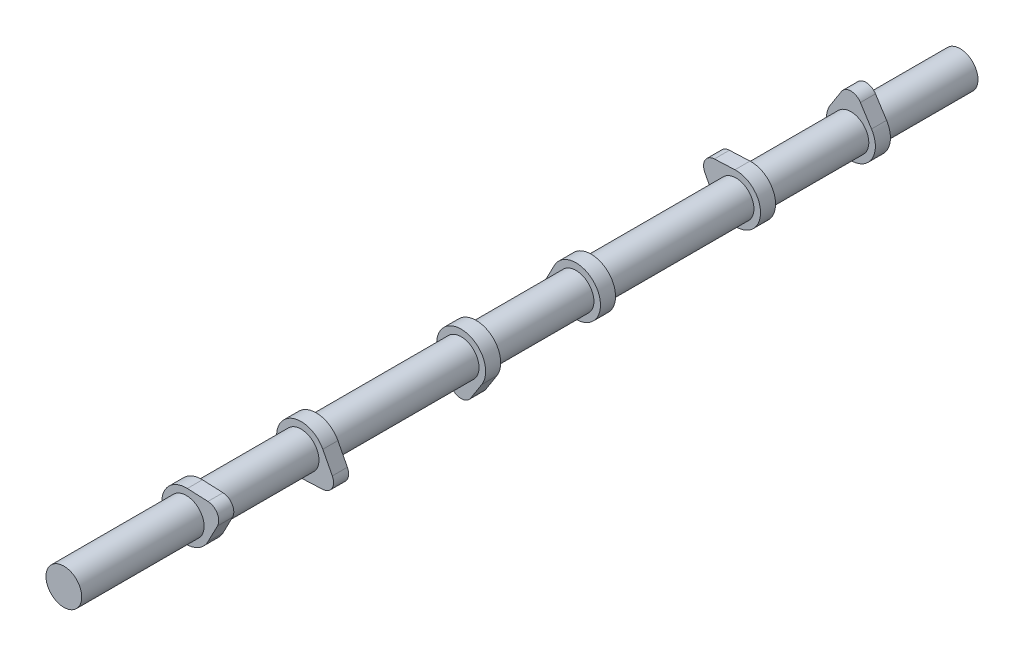
ISO-10303-21;
HEADER;
FILE_DESCRIPTION(('STEP AP214'),'2;1');
FILE_NAME('part.step','',(''),(''),'','','');
FILE_SCHEMA(('AUTOMOTIVE_DESIGN { 1 0 10303 214 1 1 1 1 }'));
ENDSEC;
DATA;
#1=APPLICATION_CONTEXT('core data for automotive mechanical design processes');
#2=APPLICATION_PROTOCOL_DEFINITION('international standard','automotive_design',2000,#1);
#3=PRODUCT_CONTEXT('',#1,'mechanical');
#4=PRODUCT('Part','Part','',(#3));
#5=PRODUCT_RELATED_PRODUCT_CATEGORY('part','',(#4));
#6=PRODUCT_DEFINITION_FORMATION('','',#4);
#7=PRODUCT_DEFINITION_CONTEXT('part definition',#1,'design');
#8=PRODUCT_DEFINITION('design','',#6,#7);
#9=PRODUCT_DEFINITION_SHAPE('','',#8);
#10=(LENGTH_UNIT() NAMED_UNIT(*) SI_UNIT(.MILLI.,.METRE.));
#11=(NAMED_UNIT(*) PLANE_ANGLE_UNIT() SI_UNIT($,.RADIAN.));
#12=(NAMED_UNIT(*) SI_UNIT($,.STERADIAN.) SOLID_ANGLE_UNIT());
#13=UNCERTAINTY_MEASURE_WITH_UNIT(LENGTH_MEASURE(1.E-05),#10,'distance_accuracy_value','');
#14=(GEOMETRIC_REPRESENTATION_CONTEXT(3) GLOBAL_UNCERTAINTY_ASSIGNED_CONTEXT((#13)) GLOBAL_UNIT_ASSIGNED_CONTEXT((#10,
#11,#12)) REPRESENTATION_CONTEXT('',''));
#15=CARTESIAN_POINT('',(0.,0.,0.));
#16=DIRECTION('',(0.,0.,1.));
#17=DIRECTION('',(1.,0.,0.));
#18=AXIS2_PLACEMENT_3D('',#15,#16,#17);
#19=CARTESIAN_POINT('',(0.,0.,476.));
#20=DIRECTION('',(0.,0.,-1.));
#21=DIRECTION('',(-1.,0.,0.));
#22=AXIS2_PLACEMENT_3D('',#19,#20,#21);
#23=CYLINDRICAL_SURFACE('',#22,9.5);
#24=CARTESIAN_POINT('',(0.,0.,350.));
#25=DIRECTION('',(0.,0.,1.));
#26=DIRECTION('',(1.,0.,0.));
#27=AXIS2_PLACEMENT_3D('',#24,#25,#26);
#28=CIRCLE('',#27,9.5);
#29=CARTESIAN_POINT('',(9.5,0.,350.));
#30=VERTEX_POINT('',#29);
#31=EDGE_CURVE('E270',#30,#30,#28,.T.);
#32=ORIENTED_EDGE('',*,*,#31,.T.);
#33=EDGE_LOOP('',(#32));
#34=FACE_BOUND('',#33,.T.);
#35=CARTESIAN_POINT('',(0.,0.,403.));
#36=DIRECTION('',(0.,0.,1.));
#37=DIRECTION('',(1.,0.,0.));
#38=AXIS2_PLACEMENT_3D('',#35,#36,#37);
#39=CIRCLE('',#38,9.5);
#40=CARTESIAN_POINT('',(9.5,0.,403.));
#41=VERTEX_POINT('',#40);
#42=EDGE_CURVE('E11',#41,#41,#39,.T.);
#43=ORIENTED_EDGE('',*,*,#42,.F.);
#44=EDGE_LOOP('',(#43));
#45=FACE_BOUND('',#44,.T.);
#46=ADVANCED_FACE('F37',(#34,#45),#23,.T.);
#47=CARTESIAN_POINT('',(0.,0.,265.));
#48=DIRECTION('',(0.,0.,1.));
#49=DIRECTION('',(1.,0.,0.));
#50=AXIS2_PLACEMENT_3D('',#47,#48,#49);
#51=CIRCLE('',#50,9.5);
#52=CARTESIAN_POINT('',(9.5,0.,265.));
#53=VERTEX_POINT('',#52);
#54=EDGE_CURVE('E301',#53,#53,#51,.T.);
#55=ORIENTED_EDGE('',*,*,#54,.T.);
#56=EDGE_LOOP('',(#55));
#57=FACE_BOUND('',#56,.T.);
#58=CARTESIAN_POINT('',(0.,0.,342.));
#59=DIRECTION('',(0.,0.,1.));
#60=DIRECTION('',(1.,0.,0.));
#61=AXIS2_PLACEMENT_3D('',#58,#59,#60);
#62=CIRCLE('',#61,9.5);
#63=CARTESIAN_POINT('',(9.5,0.,342.));
#64=VERTEX_POINT('',#63);
#65=EDGE_CURVE('E47',#64,#64,#62,.T.);
#66=ORIENTED_EDGE('',*,*,#65,.F.);
#67=EDGE_LOOP('',(#66));
#68=FACE_BOUND('',#67,.T.);
#69=ADVANCED_FACE('F455',(#57,#68),#23,.T.);
#70=CARTESIAN_POINT('',(0.,0.,204.));
#71=DIRECTION('',(0.,0.,1.));
#72=DIRECTION('',(1.,0.,0.));
#73=AXIS2_PLACEMENT_3D('',#70,#71,#72);
#74=CIRCLE('',#73,9.5);
#75=CARTESIAN_POINT('',(9.5,0.,204.));
#76=VERTEX_POINT('',#75);
#77=EDGE_CURVE('E332',#76,#76,#74,.T.);
#78=ORIENTED_EDGE('',*,*,#77,.T.);
#79=EDGE_LOOP('',(#78));
#80=FACE_BOUND('',#79,.T.);
#81=CARTESIAN_POINT('',(0.,0.,257.));
#82=DIRECTION('',(0.,0.,1.));
#83=DIRECTION('',(1.,0.,0.));
#84=AXIS2_PLACEMENT_3D('',#81,#82,#83);
#85=CIRCLE('',#84,9.5);
#86=CARTESIAN_POINT('',(9.5,0.,257.));
#87=VERTEX_POINT('',#86);
#88=EDGE_CURVE('E408',#87,#87,#85,.T.);
#89=ORIENTED_EDGE('',*,*,#88,.F.);
#90=EDGE_LOOP('',(#89));
#91=FACE_BOUND('',#90,.T.);
#92=ADVANCED_FACE('F459',(#80,#91),#23,.T.);
#93=CARTESIAN_POINT('',(0.,0.,119.));
#94=DIRECTION('',(0.,0.,1.));
#95=DIRECTION('',(1.,0.,0.));
#96=AXIS2_PLACEMENT_3D('',#93,#94,#95);
#97=CIRCLE('',#96,9.5);
#98=CARTESIAN_POINT('',(9.5,0.,119.));
#99=VERTEX_POINT('',#98);
#100=EDGE_CURVE('E363',#99,#99,#97,.T.);
#101=ORIENTED_EDGE('',*,*,#100,.T.);
#102=EDGE_LOOP('',(#101));
#103=FACE_BOUND('',#102,.T.);
#104=CARTESIAN_POINT('',(0.,0.,196.));
#105=DIRECTION('',(0.,0.,1.));
#106=DIRECTION('',(1.,0.,0.));
#107=AXIS2_PLACEMENT_3D('',#104,#105,#106);
#108=CIRCLE('',#107,9.5);
#109=CARTESIAN_POINT('',(9.5,0.,196.));
#110=VERTEX_POINT('',#109);
#111=EDGE_CURVE('E403',#110,#110,#108,.T.);
#112=ORIENTED_EDGE('',*,*,#111,.F.);
#113=EDGE_LOOP('',(#112));
#114=FACE_BOUND('',#113,.T.);
#115=ADVANCED_FACE('F489',(#103,#114),#23,.T.);
#116=CARTESIAN_POINT('',(0.,0.,58.));
#117=DIRECTION('',(0.,0.,-1.));
#118=DIRECTION('',(-1.,0.,0.));
#119=AXIS2_PLACEMENT_3D('',#116,#117,#118);
#120=CIRCLE('',#119,9.5);
#121=CARTESIAN_POINT('',(-9.5,0.,58.));
#122=VERTEX_POINT('',#121);
#123=EDGE_CURVE('E392',#122,#122,#120,.T.);
#124=ORIENTED_EDGE('',*,*,#123,.F.);
#125=EDGE_LOOP('',(#124));
#126=FACE_BOUND('',#125,.T.);
#127=CARTESIAN_POINT('',(0.,0.,111.));
#128=DIRECTION('',(0.,0.,1.));
#129=DIRECTION('',(1.,0.,0.));
#130=AXIS2_PLACEMENT_3D('',#127,#128,#129);
#131=CIRCLE('',#130,9.5);
#132=CARTESIAN_POINT('',(9.5,0.,111.));
#133=VERTEX_POINT('',#132);
#134=EDGE_CURVE('E400',#133,#133,#131,.T.);
#135=ORIENTED_EDGE('',*,*,#134,.F.);
#136=EDGE_LOOP('',(#135));
#137=FACE_BOUND('',#136,.T.);
#138=ADVANCED_FACE('F479',(#126,#137),#23,.T.);
#139=CARTESIAN_POINT('',(0.,0.,58.));
#140=DIRECTION('',(0.,0.,-1.));
#141=DIRECTION('',(-1.,0.,0.));
#142=AXIS2_PLACEMENT_3D('',#139,#140,#141);
#143=CYLINDRICAL_SURFACE('',#142,13.);
#144=CARTESIAN_POINT('',(0.,0.,50.));
#145=DIRECTION('',(0.,0.,-1.));
#146=DIRECTION('',(-1.,0.,0.));
#147=AXIS2_PLACEMENT_3D('',#144,#145,#146);
#148=CIRCLE('',#147,13.);
#149=CARTESIAN_POINT('',(10.9544511522889,6.99999999657977,50.));
#150=VERTEX_POINT('',#149);
#151=CARTESIAN_POINT('',(-10.9544511522889,6.99999999657977,50.));
#152=VERTEX_POINT('',#151);
#153=EDGE_CURVE('E373',#150,#152,#148,.T.);
#154=ORIENTED_EDGE('',*,*,#153,.F.);
#155=DIRECTION('',(0.,0.,-1.));
#156=VECTOR('',#155,1.);
#157=CARTESIAN_POINT('',(10.9544511522889,6.99999999657977,58.));
#158=LINE('',#157,#156);
#159=CARTESIAN_POINT('',(10.9544511522889,6.99999999657977,58.));
#160=VERTEX_POINT('',#159);
#161=EDGE_CURVE('E55',#160,#150,#158,.T.);
#162=ORIENTED_EDGE('',*,*,#161,.F.);
#163=CARTESIAN_POINT('',(0.,0.,58.));
#164=DIRECTION('',(0.,0.,-1.));
#165=DIRECTION('',(-1.,0.,0.));
#166=AXIS2_PLACEMENT_3D('',#163,#164,#165);
#167=CIRCLE('',#166,13.);
#168=CARTESIAN_POINT('',(-10.9544511522889,6.99999999657977,58.));
#169=VERTEX_POINT('',#168);
#170=EDGE_CURVE('E364',#160,#169,#167,.T.);
#171=ORIENTED_EDGE('',*,*,#170,.T.);
#172=DIRECTION('',(0.,0.,-1.));
#173=VECTOR('',#172,1.);
#174=CARTESIAN_POINT('',(-10.9544511522889,6.99999999657977,58.));
#175=LINE('',#174,#173);
#176=EDGE_CURVE('E84',#169,#152,#175,.T.);
#177=ORIENTED_EDGE('',*,*,#176,.T.);
#178=EDGE_LOOP('',(#154,#162,#171,#177));
#179=FACE_BOUND('',#178,.T.);
#180=ADVANCED_FACE('F488',(#179),#143,.T.);
#181=CARTESIAN_POINT('',(10.9544511522889,6.99999999657977,58.));
#182=DIRECTION('',(0.842650088637606,0.538461538198444,0.));
#183=DIRECTION('',(-0.538461538198444,0.842650088637607,0.));
#184=AXIS2_PLACEMENT_3D('',#181,#182,#183);
#185=PLANE('',#184);
#186=DIRECTION('',(0.538461538198444,-0.842650088637606,0.));
#187=VECTOR('',#186,1.);
#188=CARTESIAN_POINT('',(10.9544511522889,6.99999999657977,50.));
#189=LINE('',#188,#187);
#190=CARTESIAN_POINT('',(5.05590053470769,16.2307692310323,50.));
#191=VERTEX_POINT('',#190);
#192=EDGE_CURVE('E367',#191,#150,#189,.T.);
#193=ORIENTED_EDGE('',*,*,#192,.F.);
#194=DIRECTION('',(0.,0.,-1.));
#195=VECTOR('',#194,1.);
#196=CARTESIAN_POINT('',(5.05590053470769,16.2307692310323,58.));
#197=LINE('',#196,#195);
#198=CARTESIAN_POINT('',(5.05590053470769,16.2307692310323,58.));
#199=VERTEX_POINT('',#198);
#200=EDGE_CURVE('E73',#199,#191,#197,.T.);
#201=ORIENTED_EDGE('',*,*,#200,.F.);
#202=DIRECTION('',(0.538461538198444,-0.842650088637606,0.));
#203=VECTOR('',#202,1.);
#204=CARTESIAN_POINT('',(10.9544511522889,6.99999999657977,58.));
#205=LINE('',#204,#203);
#206=EDGE_CURVE('E371',#199,#160,#205,.T.);
#207=ORIENTED_EDGE('',*,*,#206,.T.);
#208=ORIENTED_EDGE('',*,*,#161,.T.);
#209=EDGE_LOOP('',(#193,#201,#207,#208));
#210=FACE_BOUND('',#209,.T.);
#211=ADVANCED_FACE('F495',(#210),#185,.T.);
#212=CARTESIAN_POINT('',(0.,13.,58.));
#213=DIRECTION('',(0.,0.,-1.));
#214=DIRECTION('',(-1.,0.,0.));
#215=AXIS2_PLACEMENT_3D('',#212,#213,#214);
#216=CYLINDRICAL_SURFACE('',#215,6.00000000342023);
#217=CARTESIAN_POINT('',(0.,13.,50.));
#218=DIRECTION('',(0.,0.,-1.));
#219=DIRECTION('',(-1.,0.,0.));
#220=AXIS2_PLACEMENT_3D('',#217,#218,#219);
#221=CIRCLE('',#220,6.00000000342023);
#222=CARTESIAN_POINT('',(-5.05590053369898,16.2307692326109,50.));
#223=VERTEX_POINT('',#222);
#224=EDGE_CURVE('E379',#223,#191,#221,.T.);
#225=ORIENTED_EDGE('',*,*,#224,.F.);
#226=DIRECTION('',(0.,0.,-1.));
#227=VECTOR('',#226,1.);
#228=CARTESIAN_POINT('',(-5.05590053369898,16.2307692326109,58.));
#229=LINE('',#228,#227);
#230=CARTESIAN_POINT('',(-5.05590053369898,16.2307692326109,58.));
#231=VERTEX_POINT('',#230);
#232=EDGE_CURVE('E386',#231,#223,#229,.T.);
#233=ORIENTED_EDGE('',*,*,#232,.F.);
#234=CARTESIAN_POINT('',(0.,13.,58.));
#235=DIRECTION('',(0.,0.,-1.));
#236=DIRECTION('',(-1.,0.,0.));
#237=AXIS2_PLACEMENT_3D('',#234,#235,#236);
#238=CIRCLE('',#237,6.00000000342023);
#239=EDGE_CURVE('E369',#231,#199,#238,.T.);
#240=ORIENTED_EDGE('',*,*,#239,.T.);
#241=ORIENTED_EDGE('',*,*,#200,.T.);
#242=EDGE_LOOP('',(#225,#233,#240,#241));
#243=FACE_BOUND('',#242,.T.);
#244=ADVANCED_FACE('F549',(#243),#216,.T.);
#245=CARTESIAN_POINT('',(-5.05590053369898,16.2307692326109,58.));
#246=DIRECTION('',(-0.842650088637606,0.538461538198444,0.));
#247=DIRECTION('',(-0.538461538198444,-0.842650088637606,0.));
#248=AXIS2_PLACEMENT_3D('',#245,#246,#247);
#249=PLANE('',#248);
#250=DIRECTION('',(0.538461538198444,0.842650088637606,0.));
#251=VECTOR('',#250,1.);
#252=CARTESIAN_POINT('',(-5.05590053369898,16.2307692326109,50.));
#253=LINE('',#252,#251);
#254=EDGE_CURVE('E376',#152,#223,#253,.T.);
#255=ORIENTED_EDGE('',*,*,#254,.F.);
#256=ORIENTED_EDGE('',*,*,#176,.F.);
#257=DIRECTION('',(0.538461538198444,0.842650088637606,0.));
#258=VECTOR('',#257,1.);
#259=CARTESIAN_POINT('',(-5.05590053369898,16.2307692326109,58.));
#260=LINE('',#259,#258);
#261=EDGE_CURVE('E366',#169,#231,#260,.T.);
#262=ORIENTED_EDGE('',*,*,#261,.T.);
#263=ORIENTED_EDGE('',*,*,#232,.T.);
#264=EDGE_LOOP('',(#255,#256,#262,#263));
#265=FACE_BOUND('',#264,.T.);
#266=ADVANCED_FACE('F542',(#265),#249,.T.);
#267=CARTESIAN_POINT('',(0.,0.,58.));
#268=DIRECTION('',(0.,0.,-1.));
#269=DIRECTION('',(-1.,0.,0.));
#270=AXIS2_PLACEMENT_3D('',#267,#268,#269);
#271=PLANE('',#270);
#272=ORIENTED_EDGE('',*,*,#123,.T.);
#273=EDGE_LOOP('',(#272));
#274=FACE_BOUND('',#273,.T.);
#275=ORIENTED_EDGE('',*,*,#170,.F.);
#276=ORIENTED_EDGE('',*,*,#206,.F.);
#277=ORIENTED_EDGE('',*,*,#239,.F.);
#278=ORIENTED_EDGE('',*,*,#261,.F.);
#279=EDGE_LOOP('',(#275,#276,#277,#278));
#280=FACE_BOUND('',#279,.T.);
#281=ADVANCED_FACE('F539',(#274,#280),#271,.F.);
#282=CARTESIAN_POINT('',(0.,0.,50.));
#283=DIRECTION('',(0.,0.,-1.));
#284=DIRECTION('',(-1.,0.,0.));
#285=AXIS2_PLACEMENT_3D('',#282,#283,#284);
#286=PLANE('',#285);
#287=CARTESIAN_POINT('',(0.,0.,50.));
#288=DIRECTION('',(0.,0.,-1.));
#289=DIRECTION('',(-1.,0.,0.));
#290=AXIS2_PLACEMENT_3D('',#287,#288,#289);
#291=CIRCLE('',#290,9.5);
#292=CARTESIAN_POINT('',(-9.5,0.,50.));
#293=VERTEX_POINT('',#292);
#294=EDGE_CURVE('E384',#293,#293,#291,.T.);
#295=ORIENTED_EDGE('',*,*,#294,.F.);
#296=EDGE_LOOP('',(#295));
#297=FACE_BOUND('',#296,.T.);
#298=ORIENTED_EDGE('',*,*,#153,.T.);
#299=ORIENTED_EDGE('',*,*,#254,.T.);
#300=ORIENTED_EDGE('',*,*,#224,.T.);
#301=ORIENTED_EDGE('',*,*,#192,.T.);
#302=EDGE_LOOP('',(#298,#299,#300,#301));
#303=FACE_BOUND('',#302,.T.);
#304=ADVANCED_FACE('F473',(#297,#303),#286,.T.);
#305=CARTESIAN_POINT('',(0.,0.,0.));
#306=DIRECTION('',(0.,0.,1.));
#307=DIRECTION('',(1.,0.,0.));
#308=AXIS2_PLACEMENT_3D('',#305,#306,#307);
#309=PLANE('',#308);
#310=CARTESIAN_POINT('',(0.,0.,0.));
#311=DIRECTION('',(0.,0.,1.));
#312=DIRECTION('',(1.,0.,0.));
#313=AXIS2_PLACEMENT_3D('',#310,#311,#312);
#314=CIRCLE('',#313,9.5);
#315=CARTESIAN_POINT('',(9.5,0.,0.));
#316=VERTEX_POINT('',#315);
#317=EDGE_CURVE('E393',#316,#316,#314,.T.);
#318=ORIENTED_EDGE('',*,*,#317,.F.);
#319=EDGE_LOOP('',(#318));
#320=FACE_BOUND('',#319,.T.);
#321=ADVANCED_FACE('F463',(#320),#309,.F.);
#322=ORIENTED_EDGE('',*,*,#294,.T.);
#323=EDGE_LOOP('',(#322));
#324=FACE_BOUND('',#323,.T.);
#325=ORIENTED_EDGE('',*,*,#317,.T.);
#326=EDGE_LOOP('',(#325));
#327=FACE_BOUND('',#326,.T.);
#328=ADVANCED_FACE('F39',(#324,#327),#23,.T.);
#329=CARTESIAN_POINT('',(0.,0.,119.));
#330=DIRECTION('',(0.,0.,-1.));
#331=DIRECTION('',(-1.,0.,0.));
#332=AXIS2_PLACEMENT_3D('',#329,#330,#331);
#333=CYLINDRICAL_SURFACE('',#332,13.);
#334=CARTESIAN_POINT('',(0.,0.,111.));
#335=DIRECTION('',(0.,0.,1.));
#336=DIRECTION('',(1.,0.,0.));
#337=AXIS2_PLACEMENT_3D('',#334,#335,#336);
#338=CIRCLE('',#337,13.);
#339=CARTESIAN_POINT('',(-11.5394033996734,-5.98683298410839,111.));
#340=VERTEX_POINT('',#339);
#341=CARTESIAN_POINT('',(-0.584952247385028,12.9868329806878,111.));
#342=VERTEX_POINT('',#341);
#343=EDGE_CURVE('E344',#340,#342,#338,.T.);
#344=ORIENTED_EDGE('',*,*,#343,.T.);
#345=DIRECTION('',(0.,0.,-1.));
#346=VECTOR('',#345,1.);
#347=CARTESIAN_POINT('',(-0.584952247385028,12.9868329806878,119.));
#348=LINE('',#347,#346);
#349=CARTESIAN_POINT('',(-0.584952247385028,12.9868329806878,119.));
#350=VERTEX_POINT('',#349);
#351=EDGE_CURVE('E360',#350,#342,#348,.T.);
#352=ORIENTED_EDGE('',*,*,#351,.F.);
#353=CARTESIAN_POINT('',(0.,0.,119.));
#354=DIRECTION('',(0.,0.,1.));
#355=DIRECTION('',(1.,0.,0.));
#356=AXIS2_PLACEMENT_3D('',#353,#354,#355);
#357=CIRCLE('',#356,13.);
#358=CARTESIAN_POINT('',(-11.5394033996734,-5.98683298410839,119.));
#359=VERTEX_POINT('',#358);
#360=EDGE_CURVE('E333',#359,#350,#357,.T.);
#361=ORIENTED_EDGE('',*,*,#360,.F.);
#362=DIRECTION('',(0.,0.,-1.));
#363=VECTOR('',#362,1.);
#364=CARTESIAN_POINT('',(-11.5394033996734,-5.98683298410839,119.));
#365=LINE('',#364,#363);
#366=EDGE_CURVE('E343',#359,#340,#365,.T.);
#367=ORIENTED_EDGE('',*,*,#366,.T.);
#368=EDGE_LOOP('',(#344,#352,#361,#367));
#369=FACE_BOUND('',#368,.T.);
#370=ADVANCED_FACE('F462',(#369),#333,.T.);
#371=CARTESIAN_POINT('',(-0.584952247385028,12.9868329806878,119.));
#372=DIRECTION('',(0.0449963267219259,-0.998987152360597,0.));
#373=DIRECTION('',(0.998987152360597,0.0449963267219259,0.));
#374=AXIS2_PLACEMENT_3D('',#371,#372,#373);
#375=PLANE('',#374);
#376=DIRECTION('',(-0.998987152360597,-0.0449963267219259,0.));
#377=VECTOR('',#376,1.);
#378=CARTESIAN_POINT('',(-0.584952247385028,12.9868329806878,111.));
#379=LINE('',#378,#377);
#380=CARTESIAN_POINT('',(-11.5283082096834,12.49392291758,111.));
#381=VERTEX_POINT('',#380);
#382=EDGE_CURVE('E347',#342,#381,#379,.T.);
#383=ORIENTED_EDGE('',*,*,#382,.T.);
#384=DIRECTION('',(0.,0.,-1.));
#385=VECTOR('',#384,1.);
#386=CARTESIAN_POINT('',(-11.5283082096834,12.49392291758,119.));
#387=LINE('',#386,#385);
#388=CARTESIAN_POINT('',(-11.5283082096834,12.49392291758,119.));
#389=VERTEX_POINT('',#388);
#390=EDGE_CURVE('E357',#389,#381,#387,.T.);
#391=ORIENTED_EDGE('',*,*,#390,.F.);
#392=DIRECTION('',(-0.998987152360597,-0.0449963267219259,0.));
#393=VECTOR('',#392,1.);
#394=CARTESIAN_POINT('',(-0.584952247385028,12.9868329806878,119.));
#395=LINE('',#394,#393);
#396=EDGE_CURVE('E336',#350,#389,#395,.T.);
#397=ORIENTED_EDGE('',*,*,#396,.F.);
#398=ORIENTED_EDGE('',*,*,#351,.T.);
#399=EDGE_LOOP('',(#383,#391,#397,#398));
#400=FACE_BOUND('',#399,.T.);
#401=ADVANCED_FACE('F470',(#400),#375,.F.);
#402=CARTESIAN_POINT('',(-11.2583302491979,6.49999999999966,119.));
#403=DIRECTION('',(0.,0.,-1.));
#404=DIRECTION('',(-1.,0.,0.));
#405=AXIS2_PLACEMENT_3D('',#402,#403,#404);
#406=CYLINDRICAL_SURFACE('',#405,6.00000000342024);
#407=CARTESIAN_POINT('',(-11.2583302491979,6.49999999999966,111.));
#408=DIRECTION('',(0.,0.,1.));
#409=DIRECTION('',(1.,0.,0.));
#410=AXIS2_PLACEMENT_3D('',#407,#408,#409);
#411=CIRCLE('',#410,6.00000000342024);
#412=CARTESIAN_POINT('',(-16.5842087452535,3.73684631511432,111.));
#413=VERTEX_POINT('',#412);
#414=EDGE_CURVE('E349',#381,#413,#411,.T.);
#415=ORIENTED_EDGE('',*,*,#414,.T.);
#416=DIRECTION('',(0.,0.,-1.));
#417=VECTOR('',#416,1.);
#418=CARTESIAN_POINT('',(-16.5842087452535,3.73684631511432,119.));
#419=LINE('',#418,#417);
#420=CARTESIAN_POINT('',(-16.5842087452535,3.73684631511432,119.));
#421=VERTEX_POINT('',#420);
#422=EDGE_CURVE('E354',#421,#413,#419,.T.);
#423=ORIENTED_EDGE('',*,*,#422,.F.);
#424=CARTESIAN_POINT('',(-11.2583302491979,6.49999999999966,119.));
#425=DIRECTION('',(0.,0.,1.));
#426=DIRECTION('',(1.,0.,0.));
#427=AXIS2_PLACEMENT_3D('',#424,#425,#426);
#428=CIRCLE('',#427,6.00000000342024);
#429=EDGE_CURVE('E339',#389,#421,#428,.T.);
#430=ORIENTED_EDGE('',*,*,#429,.F.);
#431=ORIENTED_EDGE('',*,*,#390,.T.);
#432=EDGE_LOOP('',(#415,#423,#430,#431));
#433=FACE_BOUND('',#432,.T.);
#434=ADVANCED_FACE('F520',(#433),#406,.T.);
#435=CARTESIAN_POINT('',(-16.5842087452535,3.73684631511432,119.));
#436=DIRECTION('',(0.887646415359486,0.460525614162182,0.));
#437=DIRECTION('',(-0.460525614162182,0.887646415359486,0.));
#438=AXIS2_PLACEMENT_3D('',#435,#436,#437);
#439=PLANE('',#438);
#440=DIRECTION('',(0.460525614162182,-0.887646415359486,0.));
#441=VECTOR('',#440,1.);
#442=CARTESIAN_POINT('',(-16.5842087452535,3.73684631511432,111.));
#443=LINE('',#442,#441);
#444=EDGE_CURVE('E337',#413,#340,#443,.T.);
#445=ORIENTED_EDGE('',*,*,#444,.T.);
#446=ORIENTED_EDGE('',*,*,#366,.F.);
#447=DIRECTION('',(0.460525614162182,-0.887646415359486,0.));
#448=VECTOR('',#447,1.);
#449=CARTESIAN_POINT('',(-16.5842087452535,3.73684631511432,119.));
#450=LINE('',#449,#448);
#451=EDGE_CURVE('E341',#421,#359,#450,.T.);
#452=ORIENTED_EDGE('',*,*,#451,.F.);
#453=ORIENTED_EDGE('',*,*,#422,.T.);
#454=EDGE_LOOP('',(#445,#446,#452,#453));
#455=FACE_BOUND('',#454,.T.);
#456=ADVANCED_FACE('F516',(#455),#439,.F.);
#457=CARTESIAN_POINT('',(0.,0.,119.));
#458=DIRECTION('',(0.,0.,1.));
#459=DIRECTION('',(1.,0.,0.));
#460=AXIS2_PLACEMENT_3D('',#457,#458,#459);
#461=PLANE('',#460);
#462=ORIENTED_EDGE('',*,*,#100,.F.);
#463=EDGE_LOOP('',(#462));
#464=FACE_BOUND('',#463,.T.);
#465=ORIENTED_EDGE('',*,*,#360,.T.);
#466=ORIENTED_EDGE('',*,*,#396,.T.);
#467=ORIENTED_EDGE('',*,*,#429,.T.);
#468=ORIENTED_EDGE('',*,*,#451,.T.);
#469=EDGE_LOOP('',(#465,#466,#467,#468));
#470=FACE_BOUND('',#469,.T.);
#471=ADVANCED_FACE('F506',(#464,#470),#461,.T.);
#472=CARTESIAN_POINT('',(0.,0.,111.));
#473=DIRECTION('',(0.,0.,1.));
#474=DIRECTION('',(1.,0.,0.));
#475=AXIS2_PLACEMENT_3D('',#472,#473,#474);
#476=PLANE('',#475);
#477=ORIENTED_EDGE('',*,*,#134,.T.);
#478=EDGE_LOOP('',(#477));
#479=FACE_BOUND('',#478,.T.);
#480=ORIENTED_EDGE('',*,*,#343,.F.);
#481=ORIENTED_EDGE('',*,*,#444,.F.);
#482=ORIENTED_EDGE('',*,*,#414,.F.);
#483=ORIENTED_EDGE('',*,*,#382,.F.);
#484=EDGE_LOOP('',(#480,#481,#482,#483));
#485=FACE_BOUND('',#484,.T.);
#486=ADVANCED_FACE('F502',(#479,#485),#476,.F.);
#487=CARTESIAN_POINT('',(0.,0.,204.));
#488=DIRECTION('',(0.,0.,-1.));
#489=DIRECTION('',(-1.,0.,0.));
#490=AXIS2_PLACEMENT_3D('',#487,#488,#489);
#491=CYLINDRICAL_SURFACE('',#490,13.);
#492=CARTESIAN_POINT('',(0.,0.,196.));
#493=DIRECTION('',(0.,0.,1.));
#494=DIRECTION('',(1.,0.,0.));
#495=AXIS2_PLACEMENT_3D('',#492,#493,#494);
#496=CIRCLE('',#495,13.);
#497=CARTESIAN_POINT('',(-0.584952247384062,-12.9868329806878,196.));
#498=VERTEX_POINT('',#497);
#499=CARTESIAN_POINT('',(-11.5394033996738,5.98683298410752,196.));
#500=VERTEX_POINT('',#499);
#501=EDGE_CURVE('E313',#498,#500,#496,.T.);
#502=ORIENTED_EDGE('',*,*,#501,.T.);
#503=DIRECTION('',(0.,0.,-1.));
#504=VECTOR('',#503,1.);
#505=CARTESIAN_POINT('',(-11.5394033996738,5.98683298410752,204.));
#506=LINE('',#505,#504);
#507=CARTESIAN_POINT('',(-11.5394033996738,5.98683298410752,204.));
#508=VERTEX_POINT('',#507);
#509=EDGE_CURVE('E329',#508,#500,#506,.T.);
#510=ORIENTED_EDGE('',*,*,#509,.F.);
#511=CARTESIAN_POINT('',(0.,0.,204.));
#512=DIRECTION('',(0.,0.,1.));
#513=DIRECTION('',(1.,0.,0.));
#514=AXIS2_PLACEMENT_3D('',#511,#512,#513);
#515=CIRCLE('',#514,13.);
#516=CARTESIAN_POINT('',(-0.584952247384062,-12.9868329806878,204.));
#517=VERTEX_POINT('',#516);
#518=EDGE_CURVE('E302',#517,#508,#515,.T.);
#519=ORIENTED_EDGE('',*,*,#518,.F.);
#520=DIRECTION('',(0.,0.,-1.));
#521=VECTOR('',#520,1.);
#522=CARTESIAN_POINT('',(-0.584952247384062,-12.9868329806878,204.));
#523=LINE('',#522,#521);
#524=EDGE_CURVE('E312',#517,#498,#523,.T.);
#525=ORIENTED_EDGE('',*,*,#524,.T.);
#526=EDGE_LOOP('',(#502,#510,#519,#525));
#527=FACE_BOUND('',#526,.T.);
#528=ADVANCED_FACE('F505',(#527),#491,.T.);
#529=CARTESIAN_POINT('',(-11.5394033996738,5.98683298410752,204.));
#530=DIRECTION('',(0.88764641535952,-0.460525614162116,0.));
#531=DIRECTION('',(0.460525614162116,0.88764641535952,0.));
#532=AXIS2_PLACEMENT_3D('',#529,#530,#531);
#533=PLANE('',#532);
#534=DIRECTION('',(-0.460525614162116,-0.88764641535952,0.));
#535=VECTOR('',#534,1.);
#536=CARTESIAN_POINT('',(-11.5394033996738,5.98683298410752,196.));
#537=LINE('',#536,#535);
#538=CARTESIAN_POINT('',(-16.5842087443905,-3.73684631345269,196.));
#539=VERTEX_POINT('',#538);
#540=EDGE_CURVE('E316',#500,#539,#537,.T.);
#541=ORIENTED_EDGE('',*,*,#540,.T.);
#542=DIRECTION('',(0.,0.,-1.));
#543=VECTOR('',#542,1.);
#544=CARTESIAN_POINT('',(-16.5842087443905,-3.73684631345269,204.));
#545=LINE('',#544,#543);
#546=CARTESIAN_POINT('',(-16.5842087443905,-3.73684631345269,204.));
#547=VERTEX_POINT('',#546);
#548=EDGE_CURVE('E326',#547,#539,#545,.T.);
#549=ORIENTED_EDGE('',*,*,#548,.F.);
#550=DIRECTION('',(-0.460525614162116,-0.88764641535952,0.));
#551=VECTOR('',#550,1.);
#552=CARTESIAN_POINT('',(-11.5394033996738,5.98683298410752,204.));
#553=LINE('',#552,#551);
#554=EDGE_CURVE('E305',#508,#547,#553,.T.);
#555=ORIENTED_EDGE('',*,*,#554,.F.);
#556=ORIENTED_EDGE('',*,*,#509,.T.);
#557=EDGE_LOOP('',(#541,#549,#555,#556));
#558=FACE_BOUND('',#557,.T.);
#559=ADVANCED_FACE('F673',(#558),#533,.F.);
#560=CARTESIAN_POINT('',(-11.2583302491974,-6.5000000000005,204.));
#561=DIRECTION('',(0.,0.,-1.));
#562=DIRECTION('',(-1.,0.,0.));
#563=AXIS2_PLACEMENT_3D('',#560,#561,#562);
#564=CYLINDRICAL_SURFACE('',#563,6.00000000342023);
#565=CARTESIAN_POINT('',(-11.2583302491974,-6.5000000000005,196.));
#566=DIRECTION('',(0.,0.,1.));
#567=DIRECTION('',(1.,0.,0.));
#568=AXIS2_PLACEMENT_3D('',#565,#566,#567);
#569=CIRCLE('',#568,6.00000000342023);
#570=CARTESIAN_POINT('',(-11.5283082115539,-12.4939229174966,196.));
#571=VERTEX_POINT('',#570);
#572=EDGE_CURVE('E318',#539,#571,#569,.T.);
#573=ORIENTED_EDGE('',*,*,#572,.T.);
#574=DIRECTION('',(0.,0.,-1.));
#575=VECTOR('',#574,1.);
#576=CARTESIAN_POINT('',(-11.5283082115539,-12.4939229174966,204.));
#577=LINE('',#576,#575);
#578=CARTESIAN_POINT('',(-11.5283082115539,-12.4939229174966,204.));
#579=VERTEX_POINT('',#578);
#580=EDGE_CURVE('E323',#579,#571,#577,.T.);
#581=ORIENTED_EDGE('',*,*,#580,.F.);
#582=CARTESIAN_POINT('',(-11.2583302491974,-6.5000000000005,204.));
#583=DIRECTION('',(0.,0.,1.));
#584=DIRECTION('',(1.,0.,0.));
#585=AXIS2_PLACEMENT_3D('',#582,#583,#584);
#586=CIRCLE('',#585,6.00000000342023);
#587=EDGE_CURVE('E308',#547,#579,#586,.T.);
#588=ORIENTED_EDGE('',*,*,#587,.F.);
#589=ORIENTED_EDGE('',*,*,#548,.T.);
#590=EDGE_LOOP('',(#573,#581,#588,#589));
#591=FACE_BOUND('',#590,.T.);
#592=ADVANCED_FACE('F683',(#591),#564,.T.);
#593=CARTESIAN_POINT('',(-11.5283082115539,-12.4939229174966,204.));
#594=DIRECTION('',(0.0449963267218519,0.9989871523606,0.));
#595=DIRECTION('',(-0.9989871523606,0.0449963267218519,0.));
#596=AXIS2_PLACEMENT_3D('',#593,#594,#595);
#597=PLANE('',#596);
#598=DIRECTION('',(0.9989871523606,-0.0449963267218519,0.));
#599=VECTOR('',#598,1.);
#600=CARTESIAN_POINT('',(-11.5283082115539,-12.4939229174966,196.));
#601=LINE('',#600,#599);
#602=EDGE_CURVE('E306',#571,#498,#601,.T.);
#603=ORIENTED_EDGE('',*,*,#602,.T.);
#604=ORIENTED_EDGE('',*,*,#524,.F.);
#605=DIRECTION('',(0.9989871523606,-0.0449963267218519,0.));
#606=VECTOR('',#605,1.);
#607=CARTESIAN_POINT('',(-11.5283082115539,-12.4939229174966,204.));
#608=LINE('',#607,#606);
#609=EDGE_CURVE('E310',#579,#517,#608,.T.);
#610=ORIENTED_EDGE('',*,*,#609,.F.);
#611=ORIENTED_EDGE('',*,*,#580,.T.);
#612=EDGE_LOOP('',(#603,#604,#610,#611));
#613=FACE_BOUND('',#612,.T.);
#614=ADVANCED_FACE('F693',(#613),#597,.F.);
#615=CARTESIAN_POINT('',(0.,0.,204.));
#616=DIRECTION('',(0.,0.,1.));
#617=DIRECTION('',(1.,0.,0.));
#618=AXIS2_PLACEMENT_3D('',#615,#616,#617);
#619=PLANE('',#618);
#620=ORIENTED_EDGE('',*,*,#77,.F.);
#621=EDGE_LOOP('',(#620));
#622=FACE_BOUND('',#621,.T.);
#623=ORIENTED_EDGE('',*,*,#518,.T.);
#624=ORIENTED_EDGE('',*,*,#554,.T.);
#625=ORIENTED_EDGE('',*,*,#587,.T.);
#626=ORIENTED_EDGE('',*,*,#609,.T.);
#627=EDGE_LOOP('',(#623,#624,#625,#626));
#628=FACE_BOUND('',#627,.T.);
#629=ADVANCED_FACE('F704',(#622,#628),#619,.T.);
#630=CARTESIAN_POINT('',(0.,0.,196.));
#631=DIRECTION('',(0.,0.,1.));
#632=DIRECTION('',(1.,0.,0.));
#633=AXIS2_PLACEMENT_3D('',#630,#631,#632);
#634=PLANE('',#633);
#635=ORIENTED_EDGE('',*,*,#111,.T.);
#636=EDGE_LOOP('',(#635));
#637=FACE_BOUND('',#636,.T.);
#638=ORIENTED_EDGE('',*,*,#501,.F.);
#639=ORIENTED_EDGE('',*,*,#602,.F.);
#640=ORIENTED_EDGE('',*,*,#572,.F.);
#641=ORIENTED_EDGE('',*,*,#540,.F.);
#642=EDGE_LOOP('',(#638,#639,#640,#641));
#643=FACE_BOUND('',#642,.T.);
#644=ADVANCED_FACE('F715',(#637,#643),#634,.F.);
#645=CARTESIAN_POINT('',(0.,0.,265.));
#646=DIRECTION('',(0.,0.,-1.));
#647=DIRECTION('',(-1.,0.,0.));
#648=AXIS2_PLACEMENT_3D('',#645,#646,#647);
#649=CYLINDRICAL_SURFACE('',#648,13.);
#650=CARTESIAN_POINT('',(0.,0.,257.));
#651=DIRECTION('',(0.,0.,1.));
#652=DIRECTION('',(1.,0.,0.));
#653=AXIS2_PLACEMENT_3D('',#650,#651,#652);
#654=CIRCLE('',#653,13.);
#655=CARTESIAN_POINT('',(10.9544511522893,-6.9999999965792,257.));
#656=VERTEX_POINT('',#655);
#657=CARTESIAN_POINT('',(-10.9544511522885,-6.99999999658035,257.));
#658=VERTEX_POINT('',#657);
#659=EDGE_CURVE('E282',#656,#658,#654,.T.);
#660=ORIENTED_EDGE('',*,*,#659,.T.);
#661=DIRECTION('',(0.,0.,-1.));
#662=VECTOR('',#661,1.);
#663=CARTESIAN_POINT('',(-10.9544511522885,-6.99999999658035,265.));
#664=LINE('',#663,#662);
#665=CARTESIAN_POINT('',(-10.9544511522885,-6.99999999658035,265.));
#666=VERTEX_POINT('',#665);
#667=EDGE_CURVE('E298',#666,#658,#664,.T.);
#668=ORIENTED_EDGE('',*,*,#667,.F.);
#669=CARTESIAN_POINT('',(0.,0.,265.));
#670=DIRECTION('',(0.,0.,1.));
#671=DIRECTION('',(1.,0.,0.));
#672=AXIS2_PLACEMENT_3D('',#669,#670,#671);
#673=CIRCLE('',#672,13.);
#674=CARTESIAN_POINT('',(10.9544511522893,-6.9999999965792,265.));
#675=VERTEX_POINT('',#674);
#676=EDGE_CURVE('E271',#675,#666,#673,.T.);
#677=ORIENTED_EDGE('',*,*,#676,.F.);
#678=DIRECTION('',(0.,0.,-1.));
#679=VECTOR('',#678,1.);
#680=CARTESIAN_POINT('',(10.9544511522893,-6.9999999965792,265.));
#681=LINE('',#680,#679);
#682=EDGE_CURVE('E281',#675,#656,#681,.T.);
#683=ORIENTED_EDGE('',*,*,#682,.T.);
#684=EDGE_LOOP('',(#660,#668,#677,#683));
#685=FACE_BOUND('',#684,.T.);
#686=ADVANCED_FACE('F726',(#685),#649,.T.);
#687=CARTESIAN_POINT('',(-10.9544511522885,-6.99999999658035,265.));
#688=DIRECTION('',(0.842650088637578,0.538461538198489,0.));
#689=DIRECTION('',(-0.538461538198489,0.842650088637578,0.));
#690=AXIS2_PLACEMENT_3D('',#687,#688,#689);
#691=PLANE('',#690);
#692=DIRECTION('',(0.538461538198489,-0.842650088637578,0.));
#693=VECTOR('',#692,1.);
#694=CARTESIAN_POINT('',(-10.9544511522885,-6.99999999658035,257.));
#695=LINE('',#694,#693);
#696=CARTESIAN_POINT('',(-5.05590053470686,-16.2307692310326,257.));
#697=VERTEX_POINT('',#696);
#698=EDGE_CURVE('E285',#658,#697,#695,.T.);
#699=ORIENTED_EDGE('',*,*,#698,.T.);
#700=DIRECTION('',(0.,0.,-1.));
#701=VECTOR('',#700,1.);
#702=CARTESIAN_POINT('',(-5.05590053470686,-16.2307692310326,265.));
#703=LINE('',#702,#701);
#704=CARTESIAN_POINT('',(-5.05590053470686,-16.2307692310326,265.));
#705=VERTEX_POINT('',#704);
#706=EDGE_CURVE('E295',#705,#697,#703,.T.);
#707=ORIENTED_EDGE('',*,*,#706,.F.);
#708=DIRECTION('',(0.538461538198489,-0.842650088637578,0.));
#709=VECTOR('',#708,1.);
#710=CARTESIAN_POINT('',(-10.9544511522885,-6.99999999658035,265.));
#711=LINE('',#710,#709);
#712=EDGE_CURVE('E274',#666,#705,#711,.T.);
#713=ORIENTED_EDGE('',*,*,#712,.F.);
#714=ORIENTED_EDGE('',*,*,#667,.T.);
#715=EDGE_LOOP('',(#699,#707,#713,#714));
#716=FACE_BOUND('',#715,.T.);
#717=ADVANCED_FACE('F745',(#716),#691,.F.);
#718=CARTESIAN_POINT('',(6.77982411428071E-13,-13.,265.));
#719=DIRECTION('',(0.,0.,-1.));
#720=DIRECTION('',(-1.,0.,0.));
#721=AXIS2_PLACEMENT_3D('',#718,#719,#720);
#722=CYLINDRICAL_SURFACE('',#721,6.00000000342023);
#723=CARTESIAN_POINT('',(6.77982411428071E-13,-13.,257.));
#724=DIRECTION('',(0.,0.,1.));
#725=DIRECTION('',(1.,0.,0.));
#726=AXIS2_PLACEMENT_3D('',#723,#724,#725);
#727=CIRCLE('',#726,6.00000000342023);
#728=CARTESIAN_POINT('',(5.05590053369983,-16.2307692326107,257.));
#729=VERTEX_POINT('',#728);
#730=EDGE_CURVE('E287',#697,#729,#727,.T.);
#731=ORIENTED_EDGE('',*,*,#730,.T.);
#732=DIRECTION('',(0.,0.,-1.));
#733=VECTOR('',#732,1.);
#734=CARTESIAN_POINT('',(5.05590053369983,-16.2307692326107,265.));
#735=LINE('',#734,#733);
#736=CARTESIAN_POINT('',(5.05590053369983,-16.2307692326107,265.));
#737=VERTEX_POINT('',#736);
#738=EDGE_CURVE('E292',#737,#729,#735,.T.);
#739=ORIENTED_EDGE('',*,*,#738,.F.);
#740=CARTESIAN_POINT('',(6.77982411428071E-13,-13.,265.));
#741=DIRECTION('',(0.,0.,1.));
#742=DIRECTION('',(1.,0.,0.));
#743=AXIS2_PLACEMENT_3D('',#740,#741,#742);
#744=CIRCLE('',#743,6.00000000342023);
#745=EDGE_CURVE('E277',#705,#737,#744,.T.);
#746=ORIENTED_EDGE('',*,*,#745,.F.);
#747=ORIENTED_EDGE('',*,*,#706,.T.);
#748=EDGE_LOOP('',(#731,#739,#746,#747));
#749=FACE_BOUND('',#748,.T.);
#750=ADVANCED_FACE('F756',(#749),#722,.T.);
#751=CARTESIAN_POINT('',(5.05590053369983,-16.2307692326107,265.));
#752=DIRECTION('',(-0.842650088637635,0.538461538198399,0.));
#753=DIRECTION('',(-0.538461538198399,-0.842650088637635,0.));
#754=AXIS2_PLACEMENT_3D('',#751,#752,#753);
#755=PLANE('',#754);
#756=DIRECTION('',(0.538461538198399,0.842650088637635,0.));
#757=VECTOR('',#756,1.);
#758=CARTESIAN_POINT('',(5.05590053369983,-16.2307692326107,257.));
#759=LINE('',#758,#757);
#760=EDGE_CURVE('E275',#729,#656,#759,.T.);
#761=ORIENTED_EDGE('',*,*,#760,.T.);
#762=ORIENTED_EDGE('',*,*,#682,.F.);
#763=DIRECTION('',(0.538461538198399,0.842650088637635,0.));
#764=VECTOR('',#763,1.);
#765=CARTESIAN_POINT('',(5.05590053369983,-16.2307692326107,265.));
#766=LINE('',#765,#764);
#767=EDGE_CURVE('E279',#737,#675,#766,.T.);
#768=ORIENTED_EDGE('',*,*,#767,.F.);
#769=ORIENTED_EDGE('',*,*,#738,.T.);
#770=EDGE_LOOP('',(#761,#762,#768,#769));
#771=FACE_BOUND('',#770,.T.);
#772=ADVANCED_FACE('F767',(#771),#755,.F.);
#773=CARTESIAN_POINT('',(0.,0.,265.));
#774=DIRECTION('',(0.,0.,1.));
#775=DIRECTION('',(1.,0.,0.));
#776=AXIS2_PLACEMENT_3D('',#773,#774,#775);
#777=PLANE('',#776);
#778=ORIENTED_EDGE('',*,*,#54,.F.);
#779=EDGE_LOOP('',(#778));
#780=FACE_BOUND('',#779,.T.);
#781=ORIENTED_EDGE('',*,*,#676,.T.);
#782=ORIENTED_EDGE('',*,*,#712,.T.);
#783=ORIENTED_EDGE('',*,*,#745,.T.);
#784=ORIENTED_EDGE('',*,*,#767,.T.);
#785=EDGE_LOOP('',(#781,#782,#783,#784));
#786=FACE_BOUND('',#785,.T.);
#787=ADVANCED_FACE('F778',(#780,#786),#777,.T.);
#788=CARTESIAN_POINT('',(0.,0.,257.));
#789=DIRECTION('',(0.,0.,1.));
#790=DIRECTION('',(1.,0.,0.));
#791=AXIS2_PLACEMENT_3D('',#788,#789,#790);
#792=PLANE('',#791);
#793=ORIENTED_EDGE('',*,*,#88,.T.);
#794=EDGE_LOOP('',(#793));
#795=FACE_BOUND('',#794,.T.);
#796=ORIENTED_EDGE('',*,*,#659,.F.);
#797=ORIENTED_EDGE('',*,*,#760,.F.);
#798=ORIENTED_EDGE('',*,*,#730,.F.);
#799=ORIENTED_EDGE('',*,*,#698,.F.);
#800=EDGE_LOOP('',(#796,#797,#798,#799));
#801=FACE_BOUND('',#800,.T.);
#802=ADVANCED_FACE('F789',(#795,#801),#792,.F.);
#803=CARTESIAN_POINT('',(0.,0.,350.));
#804=DIRECTION('',(0.,0.,-1.));
#805=DIRECTION('',(-1.,0.,0.));
#806=AXIS2_PLACEMENT_3D('',#803,#804,#805);
#807=CYLINDRICAL_SURFACE('',#806,13.);
#808=CARTESIAN_POINT('',(0.,0.,342.));
#809=DIRECTION('',(0.,0.,1.));
#810=DIRECTION('',(1.,0.,0.));
#811=AXIS2_PLACEMENT_3D('',#808,#809,#810);
#812=CIRCLE('',#811,13.);
#813=CARTESIAN_POINT('',(11.5394033996734,5.98683298410828,342.));
#814=VERTEX_POINT('',#813);
#815=CARTESIAN_POINT('',(0.584952247384922,-12.9868329806878,342.));
#816=VERTEX_POINT('',#815);
#817=EDGE_CURVE('E236',#814,#816,#812,.T.);
#818=ORIENTED_EDGE('',*,*,#817,.T.);
#819=DIRECTION('',(0.,0.,-1.));
#820=VECTOR('',#819,1.);
#821=CARTESIAN_POINT('',(0.584952247384922,-12.9868329806878,350.));
#822=LINE('',#821,#820);
#823=CARTESIAN_POINT('',(0.584952247384922,-12.9868329806878,350.));
#824=VERTEX_POINT('',#823);
#825=EDGE_CURVE('E267',#824,#816,#822,.T.);
#826=ORIENTED_EDGE('',*,*,#825,.F.);
#827=CARTESIAN_POINT('',(0.,0.,350.));
#828=DIRECTION('',(0.,0.,1.));
#829=DIRECTION('',(1.,0.,0.));
#830=AXIS2_PLACEMENT_3D('',#827,#828,#829);
#831=CIRCLE('',#830,13.);
#832=CARTESIAN_POINT('',(11.5394033996734,5.98683298410828,350.));
#833=VERTEX_POINT('',#832);
#834=EDGE_CURVE('E241',#833,#824,#831,.T.);
#835=ORIENTED_EDGE('',*,*,#834,.F.);
#836=DIRECTION('',(0.,0.,-1.));
#837=VECTOR('',#836,1.);
#838=CARTESIAN_POINT('',(11.5394033996734,5.98683298410828,350.));
#839=LINE('',#838,#837);
#840=EDGE_CURVE('E251',#833,#814,#839,.T.);
#841=ORIENTED_EDGE('',*,*,#840,.T.);
#842=EDGE_LOOP('',(#818,#826,#835,#841));
#843=FACE_BOUND('',#842,.T.);
#844=ADVANCED_FACE('F434',(#843),#807,.T.);
#845=CARTESIAN_POINT('',(0.584952247384922,-12.9868329806878,350.));
#846=DIRECTION('',(-0.0449963267219173,0.998987152360597,0.));
#847=DIRECTION('',(-0.998987152360597,-0.0449963267219173,0.));
#848=AXIS2_PLACEMENT_3D('',#845,#846,#847);
#849=PLANE('',#848);
#850=DIRECTION('',(0.998987152360597,0.0449963267219173,0.));
#851=VECTOR('',#850,1.);
#852=CARTESIAN_POINT('',(0.584952247384922,-12.9868329806878,342.));
#853=LINE('',#852,#851);
#854=CARTESIAN_POINT('',(11.5283082096833,-12.4939229175801,342.));
#855=VERTEX_POINT('',#854);
#856=EDGE_CURVE('E254',#816,#855,#853,.T.);
#857=ORIENTED_EDGE('',*,*,#856,.T.);
#858=DIRECTION('',(0.,0.,-1.));
#859=VECTOR('',#858,1.);
#860=CARTESIAN_POINT('',(11.5283082096833,-12.4939229175801,350.));
#861=LINE('',#860,#859);
#862=CARTESIAN_POINT('',(11.5283082096833,-12.4939229175801,350.));
#863=VERTEX_POINT('',#862);
#864=EDGE_CURVE('E264',#863,#855,#861,.T.);
#865=ORIENTED_EDGE('',*,*,#864,.F.);
#866=DIRECTION('',(0.998987152360597,0.0449963267219173,0.));
#867=VECTOR('',#866,1.);
#868=CARTESIAN_POINT('',(0.584952247384922,-12.9868329806878,350.));
#869=LINE('',#868,#867);
#870=EDGE_CURVE('E244',#824,#863,#869,.T.);
#871=ORIENTED_EDGE('',*,*,#870,.F.);
#872=ORIENTED_EDGE('',*,*,#825,.T.);
#873=EDGE_LOOP('',(#857,#865,#871,#872));
#874=FACE_BOUND('',#873,.T.);
#875=ADVANCED_FACE('F437',(#874),#849,.F.);
#876=CARTESIAN_POINT('',(11.2583302491979,-6.49999999999974,350.));
#877=DIRECTION('',(0.,0.,-1.));
#878=DIRECTION('',(-1.,0.,0.));
#879=AXIS2_PLACEMENT_3D('',#876,#877,#878);
#880=CYLINDRICAL_SURFACE('',#879,6.00000000342023);
#881=CARTESIAN_POINT('',(11.2583302491979,-6.49999999999974,342.));
#882=DIRECTION('',(0.,0.,1.));
#883=DIRECTION('',(1.,0.,0.));
#884=AXIS2_PLACEMENT_3D('',#881,#882,#883);
#885=CIRCLE('',#884,6.00000000342023);
#886=CARTESIAN_POINT('',(16.5842087452535,-3.73684631511445,342.));
#887=VERTEX_POINT('',#886);
#888=EDGE_CURVE('E256',#855,#887,#885,.T.);
#889=ORIENTED_EDGE('',*,*,#888,.T.);
#890=DIRECTION('',(0.,0.,-1.));
#891=VECTOR('',#890,1.);
#892=CARTESIAN_POINT('',(16.5842087452535,-3.73684631511445,350.));
#893=LINE('',#892,#891);
#894=CARTESIAN_POINT('',(16.5842087452535,-3.73684631511445,350.));
#895=VERTEX_POINT('',#894);
#896=EDGE_CURVE('E261',#895,#887,#893,.T.);
#897=ORIENTED_EDGE('',*,*,#896,.F.);
#898=CARTESIAN_POINT('',(11.2583302491979,-6.49999999999974,350.));
#899=DIRECTION('',(0.,0.,1.));
#900=DIRECTION('',(1.,0.,0.));
#901=AXIS2_PLACEMENT_3D('',#898,#899,#900);
#902=CIRCLE('',#901,6.00000000342023);
#903=EDGE_CURVE('E247',#863,#895,#902,.T.);
#904=ORIENTED_EDGE('',*,*,#903,.F.);
#905=ORIENTED_EDGE('',*,*,#864,.T.);
#906=EDGE_LOOP('',(#889,#897,#904,#905));
#907=FACE_BOUND('',#906,.T.);
#908=ADVANCED_FACE('F442',(#907),#880,.T.);
#909=CARTESIAN_POINT('',(16.5842087452535,-3.73684631511445,350.));
#910=DIRECTION('',(-0.88764641535949,-0.460525614162175,0.));
#911=DIRECTION('',(0.460525614162175,-0.88764641535949,0.));
#912=AXIS2_PLACEMENT_3D('',#909,#910,#911);
#913=PLANE('',#912);
#914=DIRECTION('',(-0.460525614162175,0.88764641535949,0.));
#915=VECTOR('',#914,1.);
#916=CARTESIAN_POINT('',(16.5842087452535,-3.73684631511445,342.));
#917=LINE('',#916,#915);
#918=EDGE_CURVE('E245',#887,#814,#917,.T.);
#919=ORIENTED_EDGE('',*,*,#918,.T.);
#920=ORIENTED_EDGE('',*,*,#840,.F.);
#921=DIRECTION('',(-0.460525614162175,0.88764641535949,0.));
#922=VECTOR('',#921,1.);
#923=CARTESIAN_POINT('',(16.5842087452535,-3.73684631511445,350.));
#924=LINE('',#923,#922);
#925=EDGE_CURVE('E249',#895,#833,#924,.T.);
#926=ORIENTED_EDGE('',*,*,#925,.F.);
#927=ORIENTED_EDGE('',*,*,#896,.T.);
#928=EDGE_LOOP('',(#919,#920,#926,#927));
#929=FACE_BOUND('',#928,.T.);
#930=ADVANCED_FACE('F426',(#929),#913,.F.);
#931=CARTESIAN_POINT('',(0.,0.,350.));
#932=DIRECTION('',(0.,0.,1.));
#933=DIRECTION('',(1.,0.,0.));
#934=AXIS2_PLACEMENT_3D('',#931,#932,#933);
#935=PLANE('',#934);
#936=ORIENTED_EDGE('',*,*,#31,.F.);
#937=EDGE_LOOP('',(#936));
#938=FACE_BOUND('',#937,.T.);
#939=ORIENTED_EDGE('',*,*,#834,.T.);
#940=ORIENTED_EDGE('',*,*,#870,.T.);
#941=ORIENTED_EDGE('',*,*,#903,.T.);
#942=ORIENTED_EDGE('',*,*,#925,.T.);
#943=EDGE_LOOP('',(#939,#940,#941,#942));
#944=FACE_BOUND('',#943,.T.);
#945=ADVANCED_FACE('F422',(#938,#944),#935,.T.);
#946=CARTESIAN_POINT('',(0.,0.,342.));
#947=DIRECTION('',(0.,0.,1.));
#948=DIRECTION('',(1.,0.,0.));
#949=AXIS2_PLACEMENT_3D('',#946,#947,#948);
#950=PLANE('',#949);
#951=ORIENTED_EDGE('',*,*,#65,.T.);
#952=EDGE_LOOP('',(#951));
#953=FACE_BOUND('',#952,.T.);
#954=ORIENTED_EDGE('',*,*,#817,.F.);
#955=ORIENTED_EDGE('',*,*,#918,.F.);
#956=ORIENTED_EDGE('',*,*,#888,.F.);
#957=ORIENTED_EDGE('',*,*,#856,.F.);
#958=EDGE_LOOP('',(#954,#955,#956,#957));
#959=FACE_BOUND('',#958,.T.);
#960=ADVANCED_FACE('F425',(#953,#959),#950,.F.);
#961=CARTESIAN_POINT('',(0.,0.,411.));
#962=DIRECTION('',(0.,0.,-1.));
#963=DIRECTION('',(-1.,0.,0.));
#964=AXIS2_PLACEMENT_3D('',#961,#962,#963);
#965=CYLINDRICAL_SURFACE('',#964,13.);
#966=CARTESIAN_POINT('',(0.,0.,403.));
#967=DIRECTION('',(0.,0.,1.));
#968=DIRECTION('',(1.,0.,0.));
#969=AXIS2_PLACEMENT_3D('',#966,#967,#968);
#970=CIRCLE('',#969,13.);
#971=CARTESIAN_POINT('',(0.584952247384286,12.9868329806878,403.));
#972=VERTEX_POINT('',#971);
#973=CARTESIAN_POINT('',(11.5394033996737,-5.98683298410771,403.));
#974=VERTEX_POINT('',#973);
#975=EDGE_CURVE('E233',#972,#974,#970,.T.);
#976=ORIENTED_EDGE('',*,*,#975,.T.);
#977=DIRECTION('',(0.,0.,-1.));
#978=VECTOR('',#977,1.);
#979=CARTESIAN_POINT('',(11.5394033996737,-5.98683298410771,411.));
#980=LINE('',#979,#978);
#981=CARTESIAN_POINT('',(11.5394033996737,-5.98683298410771,411.));
#982=VERTEX_POINT('',#981);
#983=EDGE_CURVE('E213',#982,#974,#980,.T.);
#984=ORIENTED_EDGE('',*,*,#983,.F.);
#985=CARTESIAN_POINT('',(0.,0.,411.));
#986=DIRECTION('',(0.,0.,1.));
#987=DIRECTION('',(1.,0.,0.));
#988=AXIS2_PLACEMENT_3D('',#985,#986,#987);
#989=CIRCLE('',#988,13.);
#990=CARTESIAN_POINT('',(0.584952247384286,12.9868329806878,411.));
#991=VERTEX_POINT('',#990);
#992=EDGE_CURVE('E220',#991,#982,#989,.T.);
#993=ORIENTED_EDGE('',*,*,#992,.F.);
#994=DIRECTION('',(0.,0.,-1.));
#995=VECTOR('',#994,1.);
#996=CARTESIAN_POINT('',(0.584952247384286,12.9868329806878,411.));
#997=LINE('',#996,#995);
#998=EDGE_CURVE('E959',#991,#972,#997,.T.);
#999=ORIENTED_EDGE('',*,*,#998,.T.);
#1000=EDGE_LOOP('',(#976,#984,#993,#999));
#1001=FACE_BOUND('',#1000,.T.);
#1002=ADVANCED_FACE('F231',(#1001),#965,.T.);
#1003=CARTESIAN_POINT('',(11.5394033996737,-5.98683298410771,411.));
#1004=DIRECTION('',(-0.887646415359512,0.460525614162131,0.));
#1005=DIRECTION('',(-0.460525614162131,-0.887646415359512,0.));
#1006=AXIS2_PLACEMENT_3D('',#1003,#1004,#1005);
#1007=PLANE('',#1006);
#1008=DIRECTION('',(0.460525614162131,0.887646415359512,0.));
#1009=VECTOR('',#1008,1.);
#1010=CARTESIAN_POINT('',(11.5394033996737,-5.98683298410771,403.));
#1011=LINE('',#1010,#1009);
#1012=CARTESIAN_POINT('',(16.5842087443906,3.7368463134524,403.));
#1013=VERTEX_POINT('',#1012);
#1014=EDGE_CURVE('E950',#974,#1013,#1011,.T.);
#1015=ORIENTED_EDGE('',*,*,#1014,.T.);
#1016=DIRECTION('',(0.,0.,-1.));
#1017=VECTOR('',#1016,1.);
#1018=CARTESIAN_POINT('',(16.5842087443906,3.7368463134524,411.));
#1019=LINE('',#1018,#1017);
#1020=CARTESIAN_POINT('',(16.5842087443906,3.7368463134524,411.));
#1021=VERTEX_POINT('',#1020);
#1022=EDGE_CURVE('E216',#1021,#1013,#1019,.T.);
#1023=ORIENTED_EDGE('',*,*,#1022,.F.);
#1024=DIRECTION('',(0.460525614162131,0.887646415359512,0.));
#1025=VECTOR('',#1024,1.);
#1026=CARTESIAN_POINT('',(11.5394033996737,-5.98683298410771,411.));
#1027=LINE('',#1026,#1025);
#1028=EDGE_CURVE('E209',#982,#1021,#1027,.T.);
#1029=ORIENTED_EDGE('',*,*,#1028,.F.);
#1030=ORIENTED_EDGE('',*,*,#983,.T.);
#1031=EDGE_LOOP('',(#1015,#1023,#1029,#1030));
#1032=FACE_BOUND('',#1031,.T.);
#1033=ADVANCED_FACE('F211',(#1032),#1007,.F.);
#1034=CARTESIAN_POINT('',(11.2583302491975,6.50000000000029,411.));
#1035=DIRECTION('',(0.,0.,-1.));
#1036=DIRECTION('',(-1.,0.,0.));
#1037=AXIS2_PLACEMENT_3D('',#1034,#1035,#1036);
#1038=CYLINDRICAL_SURFACE('',#1037,6.00000000342023);
#1039=CARTESIAN_POINT('',(11.2583302491975,6.50000000000029,403.));
#1040=DIRECTION('',(0.,0.,1.));
#1041=DIRECTION('',(1.,0.,0.));
#1042=AXIS2_PLACEMENT_3D('',#1039,#1040,#1041);
#1043=CIRCLE('',#1042,6.00000000342023);
#1044=CARTESIAN_POINT('',(11.5283082115541,12.4939229174964,403.));
#1045=VERTEX_POINT('',#1044);
#1046=EDGE_CURVE('E952',#1013,#1045,#1043,.T.);
#1047=ORIENTED_EDGE('',*,*,#1046,.T.);
#1048=DIRECTION('',(0.,0.,-1.));
#1049=VECTOR('',#1048,1.);
#1050=CARTESIAN_POINT('',(11.5283082115541,12.4939229174964,411.));
#1051=LINE('',#1050,#1049);
#1052=CARTESIAN_POINT('',(11.5283082115541,12.4939229174964,411.));
#1053=VERTEX_POINT('',#1052);
#1054=EDGE_CURVE('E237',#1053,#1045,#1051,.T.);
#1055=ORIENTED_EDGE('',*,*,#1054,.F.);
#1056=CARTESIAN_POINT('',(11.2583302491975,6.50000000000029,411.));
#1057=DIRECTION('',(0.,0.,1.));
#1058=DIRECTION('',(1.,0.,0.));
#1059=AXIS2_PLACEMENT_3D('',#1056,#1057,#1058);
#1060=CIRCLE('',#1059,6.00000000342023);
#1061=EDGE_CURVE('E219',#1021,#1053,#1060,.T.);
#1062=ORIENTED_EDGE('',*,*,#1061,.F.);
#1063=ORIENTED_EDGE('',*,*,#1022,.T.);
#1064=EDGE_LOOP('',(#1047,#1055,#1062,#1063));
#1065=FACE_BOUND('',#1064,.T.);
#1066=ADVANCED_FACE('F876',(#1065),#1038,.T.);
#1067=CARTESIAN_POINT('',(11.5283082115541,12.4939229174964,411.));
#1068=DIRECTION('',(-0.0449963267218684,-0.998987152360599,0.));
#1069=DIRECTION('',(0.998987152360599,-0.0449963267218684,0.));
#1070=AXIS2_PLACEMENT_3D('',#1067,#1068,#1069);
#1071=PLANE('',#1070);
#1072=DIRECTION('',(-0.998987152360599,0.0449963267218684,0.));
#1073=VECTOR('',#1072,1.);
#1074=CARTESIAN_POINT('',(11.5283082115541,12.4939229174964,403.));
#1075=LINE('',#1074,#1073);
#1076=EDGE_CURVE('E229',#1045,#972,#1075,.T.);
#1077=ORIENTED_EDGE('',*,*,#1076,.T.);
#1078=ORIENTED_EDGE('',*,*,#998,.F.);
#1079=DIRECTION('',(-0.998987152360599,0.0449963267218684,0.));
#1080=VECTOR('',#1079,1.);
#1081=CARTESIAN_POINT('',(11.5283082115541,12.4939229174964,411.));
#1082=LINE('',#1081,#1080);
#1083=EDGE_CURVE('E225',#1053,#991,#1082,.T.);
#1084=ORIENTED_EDGE('',*,*,#1083,.F.);
#1085=ORIENTED_EDGE('',*,*,#1054,.T.);
#1086=EDGE_LOOP('',(#1077,#1078,#1084,#1085));
#1087=FACE_BOUND('',#1086,.T.);
#1088=ADVANCED_FACE('F886',(#1087),#1071,.F.);
#1089=CARTESIAN_POINT('',(0.,0.,411.));
#1090=DIRECTION('',(0.,0.,1.));
#1091=DIRECTION('',(1.,0.,0.));
#1092=AXIS2_PLACEMENT_3D('',#1089,#1090,#1091);
#1093=PLANE('',#1092);
#1094=CARTESIAN_POINT('',(0.,0.,411.));
#1095=DIRECTION('',(0.,0.,1.));
#1096=DIRECTION('',(1.,0.,0.));
#1097=AXIS2_PLACEMENT_3D('',#1094,#1095,#1096);
#1098=CIRCLE('',#1097,9.5);
#1099=CARTESIAN_POINT('',(9.5,0.,411.));
#1100=VERTEX_POINT('',#1099);
#1101=EDGE_CURVE('E41',#1100,#1100,#1098,.T.);
#1102=ORIENTED_EDGE('',*,*,#1101,.F.);
#1103=EDGE_LOOP('',(#1102));
#1104=FACE_BOUND('',#1103,.T.);
#1105=ORIENTED_EDGE('',*,*,#992,.T.);
#1106=ORIENTED_EDGE('',*,*,#1028,.T.);
#1107=ORIENTED_EDGE('',*,*,#1061,.T.);
#1108=ORIENTED_EDGE('',*,*,#1083,.T.);
#1109=EDGE_LOOP('',(#1105,#1106,#1107,#1108));
#1110=FACE_BOUND('',#1109,.T.);
#1111=ADVANCED_FACE('F223',(#1104,#1110),#1093,.T.);
#1112=CARTESIAN_POINT('',(0.,0.,403.));
#1113=DIRECTION('',(0.,0.,1.));
#1114=DIRECTION('',(1.,0.,0.));
#1115=AXIS2_PLACEMENT_3D('',#1112,#1113,#1114);
#1116=PLANE('',#1115);
#1117=ORIENTED_EDGE('',*,*,#42,.T.);
#1118=EDGE_LOOP('',(#1117));
#1119=FACE_BOUND('',#1118,.T.);
#1120=ORIENTED_EDGE('',*,*,#975,.F.);
#1121=ORIENTED_EDGE('',*,*,#1076,.F.);
#1122=ORIENTED_EDGE('',*,*,#1046,.F.);
#1123=ORIENTED_EDGE('',*,*,#1014,.F.);
#1124=EDGE_LOOP('',(#1120,#1121,#1122,#1123));
#1125=FACE_BOUND('',#1124,.T.);
#1126=ADVANCED_FACE('F483',(#1119,#1125),#1116,.F.);
#1127=CARTESIAN_POINT('',(0.,0.,476.));
#1128=DIRECTION('',(0.,0.,1.));
#1129=DIRECTION('',(1.,0.,0.));
#1130=AXIS2_PLACEMENT_3D('',#1127,#1128,#1129);
#1131=PLANE('',#1130);
#1132=CARTESIAN_POINT('',(0.,0.,476.));
#1133=DIRECTION('',(0.,0.,1.));
#1134=DIRECTION('',(1.,0.,0.));
#1135=AXIS2_PLACEMENT_3D('',#1132,#1133,#1134);
#1136=CIRCLE('',#1135,9.5);
#1137=CARTESIAN_POINT('',(9.5,0.,476.));
#1138=VERTEX_POINT('',#1137);
#1139=EDGE_CURVE('E389',#1138,#1138,#1136,.T.);
#1140=ORIENTED_EDGE('',*,*,#1139,.T.);
#1141=EDGE_LOOP('',(#1140));
#1142=FACE_BOUND('',#1141,.T.);
#1143=ADVANCED_FACE('F477',(#1142),#1131,.T.);
#1144=ORIENTED_EDGE('',*,*,#1101,.T.);
#1145=EDGE_LOOP('',(#1144));
#1146=FACE_BOUND('',#1145,.T.);
#1147=ORIENTED_EDGE('',*,*,#1139,.F.);
#1148=EDGE_LOOP('',(#1147));
#1149=FACE_BOUND('',#1148,.T.);
#1150=ADVANCED_FACE('F465',(#1146,#1149),#23,.T.);
#1151=CLOSED_SHELL('',(#46,#69,#92,#115,#138,#180,#211,#244,#266,#281,#304,#321,#328,#370,#401,
#434,#456,#471,#486,#528,#559,#592,#614,#629,#644,#686,#717,#750,#772,#787,#802,#844,#875,#908,
#930,#945,#960,#1002,#1033,#1066,#1088,#1111,#1126,#1143,#1150));
#1152=MANIFOLD_SOLID_BREP('B2',#1151);
#1153=ADVANCED_BREP_SHAPE_REPRESENTATION('',(#18,#1152),#14);
#1154=SHAPE_DEFINITION_REPRESENTATION(#9,#1153);
ENDSEC;
END-ISO-10303-21;
